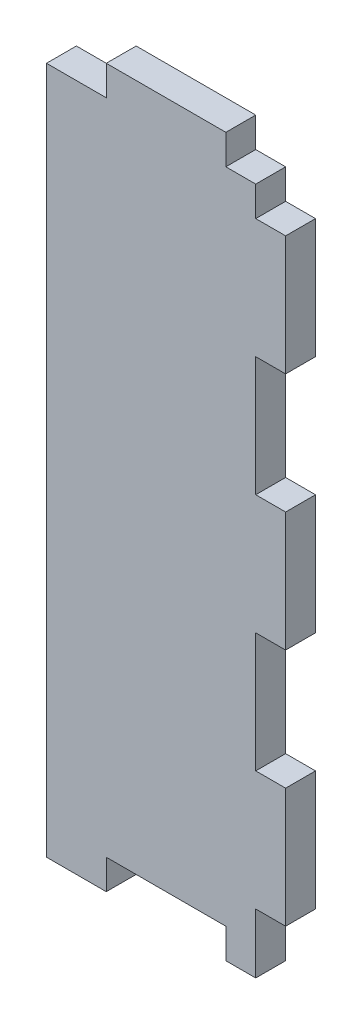
ISO-10303-21;
HEADER;
FILE_DESCRIPTION(('STEP AP214'),'2;1');
FILE_NAME('part.step','',(''),(''),'','','');
FILE_SCHEMA(('AUTOMOTIVE_DESIGN { 1 0 10303 214 1 1 1 1 }'));
ENDSEC;
DATA;
#1=APPLICATION_CONTEXT('core data for automotive mechanical design processes');
#2=APPLICATION_PROTOCOL_DEFINITION('international standard','automotive_design',2000,#1);
#3=PRODUCT_CONTEXT('',#1,'mechanical');
#4=PRODUCT('Part','Part','',(#3));
#5=PRODUCT_RELATED_PRODUCT_CATEGORY('part','',(#4));
#6=PRODUCT_DEFINITION_FORMATION('','',#4);
#7=PRODUCT_DEFINITION_CONTEXT('part definition',#1,'design');
#8=PRODUCT_DEFINITION('design','',#6,#7);
#9=PRODUCT_DEFINITION_SHAPE('','',#8);
#10=(LENGTH_UNIT() NAMED_UNIT(*) SI_UNIT(.MILLI.,.METRE.));
#11=(NAMED_UNIT(*) PLANE_ANGLE_UNIT() SI_UNIT($,.RADIAN.));
#12=(NAMED_UNIT(*) SI_UNIT($,.STERADIAN.) SOLID_ANGLE_UNIT());
#13=UNCERTAINTY_MEASURE_WITH_UNIT(LENGTH_MEASURE(1.E-05),#10,'distance_accuracy_value','');
#14=(GEOMETRIC_REPRESENTATION_CONTEXT(3) GLOBAL_UNCERTAINTY_ASSIGNED_CONTEXT((#13)) GLOBAL_UNIT_ASSIGNED_CONTEXT((#10,
#11,#12)) REPRESENTATION_CONTEXT('',''));
#15=CARTESIAN_POINT('',(0.,0.,0.));
#16=DIRECTION('',(0.,0.,1.));
#17=DIRECTION('',(1.,0.,0.));
#18=AXIS2_PLACEMENT_3D('',#15,#16,#17);
#19=CARTESIAN_POINT('',(0.,0.,3.175));
#20=DIRECTION('',(0.,1.,0.));
#21=DIRECTION('',(0.,0.,1.));
#22=AXIS2_PLACEMENT_3D('',#19,#20,#21);
#23=PLANE('',#22);
#24=DIRECTION('',(1.,0.,0.));
#25=VECTOR('',#24,1.);
#26=CARTESIAN_POINT('',(0.,0.,3.175));
#27=LINE('',#26,#25);
#28=CARTESIAN_POINT('',(19.05,0.,3.175));
#29=VERTEX_POINT('',#28);
#30=CARTESIAN_POINT('',(22.225,0.,3.175));
#31=VERTEX_POINT('',#30);
#32=EDGE_CURVE('E348',#29,#31,#27,.T.);
#33=ORIENTED_EDGE('',*,*,#32,.F.);
#34=DIRECTION('',(0.,0.,1.));
#35=VECTOR('',#34,1.);
#36=CARTESIAN_POINT('',(19.05,0.,0.));
#37=LINE('',#36,#35);
#38=CARTESIAN_POINT('',(19.05,0.,0.));
#39=VERTEX_POINT('',#38);
#40=EDGE_CURVE('E249',#39,#29,#37,.T.);
#41=ORIENTED_EDGE('',*,*,#40,.F.);
#42=DIRECTION('',(1.,0.,0.));
#43=VECTOR('',#42,1.);
#44=CARTESIAN_POINT('',(0.,0.,0.));
#45=LINE('',#44,#43);
#46=CARTESIAN_POINT('',(22.225,0.,0.));
#47=VERTEX_POINT('',#46);
#48=EDGE_CURVE('E360',#39,#47,#45,.T.);
#49=ORIENTED_EDGE('',*,*,#48,.T.);
#50=DIRECTION('',(0.,0.,1.));
#51=VECTOR('',#50,1.);
#52=CARTESIAN_POINT('',(22.225,0.,0.));
#53=LINE('',#52,#51);
#54=EDGE_CURVE('E323',#47,#31,#53,.T.);
#55=ORIENTED_EDGE('',*,*,#54,.T.);
#56=EDGE_LOOP('',(#33,#41,#49,#55));
#57=FACE_BOUND('',#56,.T.);
#58=ADVANCED_FACE('F30',(#57),#23,.F.);
#59=CARTESIAN_POINT('',(25.4,0.,3.175));
#60=DIRECTION('',(-1.,0.,0.));
#61=DIRECTION('',(0.,0.,1.));
#62=AXIS2_PLACEMENT_3D('',#59,#60,#61);
#63=PLANE('',#62);
#64=DIRECTION('',(0.,1.,0.));
#65=VECTOR('',#64,1.);
#66=CARTESIAN_POINT('',(25.4,0.,0.));
#67=LINE('',#66,#65);
#68=CARTESIAN_POINT('',(25.4,6.35000000000001,0.));
#69=VERTEX_POINT('',#68);
#70=CARTESIAN_POINT('',(25.4,19.05,0.));
#71=VERTEX_POINT('',#70);
#72=EDGE_CURVE('E365',#69,#71,#67,.T.);
#73=ORIENTED_EDGE('',*,*,#72,.T.);
#74=DIRECTION('',(0.,0.,1.));
#75=VECTOR('',#74,1.);
#76=CARTESIAN_POINT('',(25.4,19.05,0.));
#77=LINE('',#76,#75);
#78=CARTESIAN_POINT('',(25.4,19.05,3.175));
#79=VERTEX_POINT('',#78);
#80=EDGE_CURVE('E275',#71,#79,#77,.T.);
#81=ORIENTED_EDGE('',*,*,#80,.T.);
#82=DIRECTION('',(0.,1.,0.));
#83=VECTOR('',#82,1.);
#84=CARTESIAN_POINT('',(25.4,0.,3.175));
#85=LINE('',#84,#83);
#86=CARTESIAN_POINT('',(25.4,6.35000000000001,3.175));
#87=VERTEX_POINT('',#86);
#88=EDGE_CURVE('E353',#87,#79,#85,.T.);
#89=ORIENTED_EDGE('',*,*,#88,.F.);
#90=DIRECTION('',(0.,0.,1.));
#91=VECTOR('',#90,1.);
#92=CARTESIAN_POINT('',(25.4,6.35000000000001,0.));
#93=LINE('',#92,#91);
#94=EDGE_CURVE('E318',#69,#87,#93,.T.);
#95=ORIENTED_EDGE('',*,*,#94,.F.);
#96=EDGE_LOOP('',(#73,#81,#89,#95));
#97=FACE_BOUND('',#96,.T.);
#98=ADVANCED_FACE('F433',(#97),#63,.F.);
#99=CARTESIAN_POINT('',(25.4,31.75,3.175));
#100=VERTEX_POINT('',#99);
#101=CARTESIAN_POINT('',(25.4,44.45,3.175));
#102=VERTEX_POINT('',#101);
#103=EDGE_CURVE('E357',#100,#102,#85,.T.);
#104=ORIENTED_EDGE('',*,*,#103,.F.);
#105=DIRECTION('',(0.,0.,1.));
#106=VECTOR('',#105,1.);
#107=CARTESIAN_POINT('',(25.4,31.75,0.));
#108=LINE('',#107,#106);
#109=CARTESIAN_POINT('',(25.4,31.75,0.));
#110=VERTEX_POINT('',#109);
#111=EDGE_CURVE('E268',#110,#100,#108,.T.);
#112=ORIENTED_EDGE('',*,*,#111,.F.);
#113=CARTESIAN_POINT('',(25.4,44.45,0.));
#114=VERTEX_POINT('',#113);
#115=EDGE_CURVE('E368',#110,#114,#67,.T.);
#116=ORIENTED_EDGE('',*,*,#115,.T.);
#117=DIRECTION('',(0.,0.,1.));
#118=VECTOR('',#117,1.);
#119=CARTESIAN_POINT('',(25.4,44.45,0.));
#120=LINE('',#119,#118);
#121=EDGE_CURVE('E302',#114,#102,#120,.T.);
#122=ORIENTED_EDGE('',*,*,#121,.T.);
#123=EDGE_LOOP('',(#104,#112,#116,#122));
#124=FACE_BOUND('',#123,.T.);
#125=ADVANCED_FACE('F415',(#124),#63,.F.);
#126=CARTESIAN_POINT('',(0.,0.,3.175));
#127=DIRECTION('',(1.,0.,0.));
#128=DIRECTION('',(0.,0.,-1.));
#129=AXIS2_PLACEMENT_3D('',#126,#127,#128);
#130=PLANE('',#129);
#131=DIRECTION('',(0.,-1.,0.));
#132=VECTOR('',#131,1.);
#133=CARTESIAN_POINT('',(0.,0.,3.175));
#134=LINE('',#133,#132);
#135=CARTESIAN_POINT('',(0.,73.025,3.175));
#136=VERTEX_POINT('',#135);
#137=CARTESIAN_POINT('',(0.,0.,3.175));
#138=VERTEX_POINT('',#137);
#139=EDGE_CURVE('E346',#136,#138,#134,.T.);
#140=ORIENTED_EDGE('',*,*,#139,.F.);
#141=DIRECTION('',(0.,0.,1.));
#142=VECTOR('',#141,1.);
#143=CARTESIAN_POINT('',(0.,73.025,0.));
#144=LINE('',#143,#142);
#145=CARTESIAN_POINT('',(0.,73.025,0.));
#146=VERTEX_POINT('',#145);
#147=EDGE_CURVE('E220',#146,#136,#144,.T.);
#148=ORIENTED_EDGE('',*,*,#147,.F.);
#149=DIRECTION('',(0.,-1.,0.));
#150=VECTOR('',#149,1.);
#151=CARTESIAN_POINT('',(0.,0.,0.));
#152=LINE('',#151,#150);
#153=CARTESIAN_POINT('',(0.,0.,0.));
#154=VERTEX_POINT('',#153);
#155=EDGE_CURVE('E343',#146,#154,#152,.T.);
#156=ORIENTED_EDGE('',*,*,#155,.T.);
#157=DIRECTION('',(0.,0.,-1.));
#158=VECTOR('',#157,1.);
#159=CARTESIAN_POINT('',(0.,0.,3.175));
#160=LINE('',#159,#158);
#161=EDGE_CURVE('E38',#138,#154,#160,.T.);
#162=ORIENTED_EDGE('',*,*,#161,.F.);
#163=EDGE_LOOP('',(#140,#148,#156,#162));
#164=FACE_BOUND('',#163,.T.);
#165=ADVANCED_FACE('F32',(#164),#130,.F.);
#166=CARTESIAN_POINT('',(6.35,0.,0.));
#167=VERTEX_POINT('',#166);
#168=EDGE_CURVE('E361',#154,#167,#45,.T.);
#169=ORIENTED_EDGE('',*,*,#168,.T.);
#170=DIRECTION('',(0.,0.,1.));
#171=VECTOR('',#170,1.);
#172=CARTESIAN_POINT('',(6.35,0.,0.));
#173=LINE('',#172,#171);
#174=CARTESIAN_POINT('',(6.35,0.,3.175));
#175=VERTEX_POINT('',#174);
#176=EDGE_CURVE('E252',#167,#175,#173,.T.);
#177=ORIENTED_EDGE('',*,*,#176,.T.);
#178=EDGE_CURVE('E349',#138,#175,#27,.T.);
#179=ORIENTED_EDGE('',*,*,#178,.F.);
#180=ORIENTED_EDGE('',*,*,#161,.T.);
#181=EDGE_LOOP('',(#169,#177,#179,#180));
#182=FACE_BOUND('',#181,.T.);
#183=ADVANCED_FACE('F373',(#182),#23,.F.);
#184=CARTESIAN_POINT('',(25.4,57.15,3.175));
#185=VERTEX_POINT('',#184);
#186=CARTESIAN_POINT('',(25.4,69.85,3.175));
#187=VERTEX_POINT('',#186);
#188=EDGE_CURVE('E352',#185,#187,#85,.T.);
#189=ORIENTED_EDGE('',*,*,#188,.F.);
#190=DIRECTION('',(0.,0.,1.));
#191=VECTOR('',#190,1.);
#192=CARTESIAN_POINT('',(25.4,57.15,0.));
#193=LINE('',#192,#191);
#194=CARTESIAN_POINT('',(25.4,57.15,0.));
#195=VERTEX_POINT('',#194);
#196=EDGE_CURVE('E294',#195,#185,#193,.T.);
#197=ORIENTED_EDGE('',*,*,#196,.F.);
#198=CARTESIAN_POINT('',(25.4,69.85,0.));
#199=VERTEX_POINT('',#198);
#200=EDGE_CURVE('E364',#195,#199,#67,.T.);
#201=ORIENTED_EDGE('',*,*,#200,.T.);
#202=DIRECTION('',(0.,0.,1.));
#203=VECTOR('',#202,1.);
#204=CARTESIAN_POINT('',(25.4,69.85,0.));
#205=LINE('',#204,#203);
#206=EDGE_CURVE('E340',#199,#187,#205,.T.);
#207=ORIENTED_EDGE('',*,*,#206,.T.);
#208=EDGE_LOOP('',(#189,#197,#201,#207));
#209=FACE_BOUND('',#208,.T.);
#210=ADVANCED_FACE('F430',(#209),#63,.F.);
#211=CARTESIAN_POINT('',(0.,76.2,3.175));
#212=DIRECTION('',(0.,-1.,0.));
#213=DIRECTION('',(0.,0.,-1.));
#214=AXIS2_PLACEMENT_3D('',#211,#212,#213);
#215=PLANE('',#214);
#216=DIRECTION('',(-1.,0.,0.));
#217=VECTOR('',#216,1.);
#218=CARTESIAN_POINT('',(0.,76.2,3.175));
#219=LINE('',#218,#217);
#220=CARTESIAN_POINT('',(19.05,76.2,3.175));
#221=VERTEX_POINT('',#220);
#222=CARTESIAN_POINT('',(6.35,76.2,3.175));
#223=VERTEX_POINT('',#222);
#224=EDGE_CURVE('E356',#221,#223,#219,.T.);
#225=ORIENTED_EDGE('',*,*,#224,.F.);
#226=DIRECTION('',(0.,0.,1.));
#227=VECTOR('',#226,1.);
#228=CARTESIAN_POINT('',(19.05,76.2,0.));
#229=LINE('',#228,#227);
#230=CARTESIAN_POINT('',(19.05,76.2,0.));
#231=VERTEX_POINT('',#230);
#232=EDGE_CURVE('E198',#231,#221,#229,.T.);
#233=ORIENTED_EDGE('',*,*,#232,.F.);
#234=DIRECTION('',(-1.,0.,0.));
#235=VECTOR('',#234,1.);
#236=CARTESIAN_POINT('',(0.,76.2,0.));
#237=LINE('',#236,#235);
#238=CARTESIAN_POINT('',(6.35,76.2,0.));
#239=VERTEX_POINT('',#238);
#240=EDGE_CURVE('E208',#231,#239,#237,.T.);
#241=ORIENTED_EDGE('',*,*,#240,.T.);
#242=DIRECTION('',(0.,0.,1.));
#243=VECTOR('',#242,1.);
#244=CARTESIAN_POINT('',(6.35,76.2,0.));
#245=LINE('',#244,#243);
#246=EDGE_CURVE('E225',#239,#223,#245,.T.);
#247=ORIENTED_EDGE('',*,*,#246,.T.);
#248=EDGE_LOOP('',(#225,#233,#241,#247));
#249=FACE_BOUND('',#248,.T.);
#250=ADVANCED_FACE('F397',(#249),#215,.F.);
#251=CARTESIAN_POINT('',(0.,76.2,3.175));
#252=DIRECTION('',(0.,0.,-1.));
#253=DIRECTION('',(-1.,0.,0.));
#254=AXIS2_PLACEMENT_3D('',#251,#252,#253);
#255=PLANE('',#254);
#256=DIRECTION('',(1.,0.,0.));
#257=VECTOR('',#256,1.);
#258=CARTESIAN_POINT('',(19.05,73.025,3.175));
#259=LINE('',#258,#257);
#260=CARTESIAN_POINT('',(19.05,73.025,3.175));
#261=VERTEX_POINT('',#260);
#262=CARTESIAN_POINT('',(22.225,73.025,3.175));
#263=VERTEX_POINT('',#262);
#264=EDGE_CURVE('E45',#261,#263,#259,.T.);
#265=ORIENTED_EDGE('',*,*,#264,.F.);
#266=DIRECTION('',(0.,-1.,0.));
#267=VECTOR('',#266,1.);
#268=CARTESIAN_POINT('',(19.05,76.2,3.175));
#269=LINE('',#268,#267);
#270=EDGE_CURVE('E197',#221,#261,#269,.T.);
#271=ORIENTED_EDGE('',*,*,#270,.F.);
#272=ORIENTED_EDGE('',*,*,#224,.T.);
#273=DIRECTION('',(0.,1.,0.));
#274=VECTOR('',#273,1.);
#275=CARTESIAN_POINT('',(6.35,76.2,3.175));
#276=LINE('',#275,#274);
#277=CARTESIAN_POINT('',(6.35,73.025,3.175));
#278=VERTEX_POINT('',#277);
#279=EDGE_CURVE('E218',#278,#223,#276,.T.);
#280=ORIENTED_EDGE('',*,*,#279,.F.);
#281=DIRECTION('',(1.,0.,0.));
#282=VECTOR('',#281,1.);
#283=CARTESIAN_POINT('',(0.,73.025,3.175));
#284=LINE('',#283,#282);
#285=EDGE_CURVE('E213',#136,#278,#284,.T.);
#286=ORIENTED_EDGE('',*,*,#285,.F.);
#287=ORIENTED_EDGE('',*,*,#139,.T.);
#288=ORIENTED_EDGE('',*,*,#178,.T.);
#289=DIRECTION('',(0.,-1.,0.));
#290=VECTOR('',#289,1.);
#291=CARTESIAN_POINT('',(6.35,0.,3.175));
#292=LINE('',#291,#290);
#293=CARTESIAN_POINT('',(6.35,3.175,3.175));
#294=VERTEX_POINT('',#293);
#295=EDGE_CURVE('E236',#294,#175,#292,.T.);
#296=ORIENTED_EDGE('',*,*,#295,.F.);
#297=DIRECTION('',(-1.,0.,0.));
#298=VECTOR('',#297,1.);
#299=CARTESIAN_POINT('',(19.05,3.175,3.175));
#300=LINE('',#299,#298);
#301=CARTESIAN_POINT('',(19.05,3.175,3.175));
#302=VERTEX_POINT('',#301);
#303=EDGE_CURVE('E245',#302,#294,#300,.T.);
#304=ORIENTED_EDGE('',*,*,#303,.F.);
#305=DIRECTION('',(0.,1.,0.));
#306=VECTOR('',#305,1.);
#307=CARTESIAN_POINT('',(19.05,0.,3.175));
#308=LINE('',#307,#306);
#309=EDGE_CURVE('E228',#29,#302,#308,.T.);
#310=ORIENTED_EDGE('',*,*,#309,.F.);
#311=ORIENTED_EDGE('',*,*,#32,.T.);
#312=DIRECTION('',(0.,-1.,0.));
#313=VECTOR('',#312,1.);
#314=CARTESIAN_POINT('',(22.225,0.,3.175));
#315=LINE('',#314,#313);
#316=CARTESIAN_POINT('',(22.225,6.35000000000001,3.175));
#317=VERTEX_POINT('',#316);
#318=EDGE_CURVE('E315',#317,#31,#315,.T.);
#319=ORIENTED_EDGE('',*,*,#318,.F.);
#320=DIRECTION('',(-1.,0.,0.));
#321=VECTOR('',#320,1.);
#322=CARTESIAN_POINT('',(25.4,6.35000000000001,3.175));
#323=LINE('',#322,#321);
#324=EDGE_CURVE('E305',#87,#317,#323,.T.);
#325=ORIENTED_EDGE('',*,*,#324,.F.);
#326=ORIENTED_EDGE('',*,*,#88,.T.);
#327=DIRECTION('',(1.,0.,0.));
#328=VECTOR('',#327,1.);
#329=CARTESIAN_POINT('',(25.4,19.05,3.175));
#330=LINE('',#329,#328);
#331=CARTESIAN_POINT('',(22.225,19.05,3.175));
#332=VERTEX_POINT('',#331);
#333=EDGE_CURVE('E262',#332,#79,#330,.T.);
#334=ORIENTED_EDGE('',*,*,#333,.F.);
#335=DIRECTION('',(0.,-1.,0.));
#336=VECTOR('',#335,1.);
#337=CARTESIAN_POINT('',(22.225,31.75,3.175));
#338=LINE('',#337,#336);
#339=CARTESIAN_POINT('',(22.225,31.75,3.175));
#340=VERTEX_POINT('',#339);
#341=EDGE_CURVE('E271',#340,#332,#338,.T.);
#342=ORIENTED_EDGE('',*,*,#341,.F.);
#343=DIRECTION('',(-1.,0.,0.));
#344=VECTOR('',#343,1.);
#345=CARTESIAN_POINT('',(25.4,31.75,3.175));
#346=LINE('',#345,#344);
#347=EDGE_CURVE('E251',#100,#340,#346,.T.);
#348=ORIENTED_EDGE('',*,*,#347,.F.);
#349=ORIENTED_EDGE('',*,*,#103,.T.);
#350=DIRECTION('',(1.,0.,0.));
#351=VECTOR('',#350,1.);
#352=CARTESIAN_POINT('',(25.4,44.45,3.175));
#353=LINE('',#352,#351);
#354=CARTESIAN_POINT('',(22.225,44.45,3.175));
#355=VERTEX_POINT('',#354);
#356=EDGE_CURVE('E288',#355,#102,#353,.T.);
#357=ORIENTED_EDGE('',*,*,#356,.F.);
#358=DIRECTION('',(0.,-1.,0.));
#359=VECTOR('',#358,1.);
#360=CARTESIAN_POINT('',(22.225,57.15,3.175));
#361=LINE('',#360,#359);
#362=CARTESIAN_POINT('',(22.225,57.15,3.175));
#363=VERTEX_POINT('',#362);
#364=EDGE_CURVE('E297',#363,#355,#361,.T.);
#365=ORIENTED_EDGE('',*,*,#364,.F.);
#366=DIRECTION('',(-1.,0.,0.));
#367=VECTOR('',#366,1.);
#368=CARTESIAN_POINT('',(25.4,57.15,3.175));
#369=LINE('',#368,#367);
#370=EDGE_CURVE('E278',#185,#363,#369,.T.);
#371=ORIENTED_EDGE('',*,*,#370,.F.);
#372=ORIENTED_EDGE('',*,*,#188,.T.);
#373=DIRECTION('',(1.,0.,0.));
#374=VECTOR('',#373,1.);
#375=CARTESIAN_POINT('',(25.4,69.85,3.175));
#376=LINE('',#375,#374);
#377=CARTESIAN_POINT('',(22.225,69.85,3.175));
#378=VERTEX_POINT('',#377);
#379=EDGE_CURVE('E333',#378,#187,#376,.T.);
#380=ORIENTED_EDGE('',*,*,#379,.F.);
#381=DIRECTION('',(0.,-1.,0.));
#382=VECTOR('',#381,1.);
#383=CARTESIAN_POINT('',(22.225,69.85,3.175));
#384=LINE('',#383,#382);
#385=EDGE_CURVE('E326',#263,#378,#384,.T.);
#386=ORIENTED_EDGE('',*,*,#385,.F.);
#387=EDGE_LOOP('',(#265,#271,#272,#280,#286,#287,#288,#296,#304,#310,#311,#319,#325,#326,#334,
#342,#348,#349,#357,#365,#371,#372,#380,#386));
#388=FACE_BOUND('',#387,.T.);
#389=ADVANCED_FACE('F389',(#388),#255,.F.);
#390=CARTESIAN_POINT('',(0.,76.2,0.));
#391=DIRECTION('',(0.,0.,-1.));
#392=DIRECTION('',(-1.,0.,0.));
#393=AXIS2_PLACEMENT_3D('',#390,#391,#392);
#394=PLANE('',#393);
#395=DIRECTION('',(0.,-1.,0.));
#396=VECTOR('',#395,1.);
#397=CARTESIAN_POINT('',(19.05,76.2,0.));
#398=LINE('',#397,#396);
#399=CARTESIAN_POINT('',(19.05,73.025,0.));
#400=VERTEX_POINT('',#399);
#401=EDGE_CURVE('E194',#231,#400,#398,.T.);
#402=ORIENTED_EDGE('',*,*,#401,.T.);
#403=DIRECTION('',(1.,0.,0.));
#404=VECTOR('',#403,1.);
#405=CARTESIAN_POINT('',(19.05,73.025,0.));
#406=LINE('',#405,#404);
#407=CARTESIAN_POINT('',(22.225,73.025,0.));
#408=VERTEX_POINT('',#407);
#409=EDGE_CURVE('E199',#400,#408,#406,.T.);
#410=ORIENTED_EDGE('',*,*,#409,.T.);
#411=DIRECTION('',(0.,-1.,0.));
#412=VECTOR('',#411,1.);
#413=CARTESIAN_POINT('',(22.225,69.85,0.));
#414=LINE('',#413,#412);
#415=CARTESIAN_POINT('',(22.225,69.85,0.));
#416=VERTEX_POINT('',#415);
#417=EDGE_CURVE('E330',#408,#416,#414,.T.);
#418=ORIENTED_EDGE('',*,*,#417,.T.);
#419=DIRECTION('',(1.,0.,0.));
#420=VECTOR('',#419,1.);
#421=CARTESIAN_POINT('',(25.4,69.85,0.));
#422=LINE('',#421,#420);
#423=EDGE_CURVE('E332',#416,#199,#422,.T.);
#424=ORIENTED_EDGE('',*,*,#423,.T.);
#425=ORIENTED_EDGE('',*,*,#200,.F.);
#426=DIRECTION('',(-1.,0.,0.));
#427=VECTOR('',#426,1.);
#428=CARTESIAN_POINT('',(25.4,57.15,0.));
#429=LINE('',#428,#427);
#430=CARTESIAN_POINT('',(22.225,57.15,0.));
#431=VERTEX_POINT('',#430);
#432=EDGE_CURVE('E284',#195,#431,#429,.T.);
#433=ORIENTED_EDGE('',*,*,#432,.T.);
#434=DIRECTION('',(0.,-1.,0.));
#435=VECTOR('',#434,1.);
#436=CARTESIAN_POINT('',(22.225,57.15,0.));
#437=LINE('',#436,#435);
#438=CARTESIAN_POINT('',(22.225,44.45,0.));
#439=VERTEX_POINT('',#438);
#440=EDGE_CURVE('E287',#431,#439,#437,.T.);
#441=ORIENTED_EDGE('',*,*,#440,.T.);
#442=DIRECTION('',(1.,0.,0.));
#443=VECTOR('',#442,1.);
#444=CARTESIAN_POINT('',(25.4,44.45,0.));
#445=LINE('',#444,#443);
#446=EDGE_CURVE('E291',#439,#114,#445,.T.);
#447=ORIENTED_EDGE('',*,*,#446,.T.);
#448=ORIENTED_EDGE('',*,*,#115,.F.);
#449=DIRECTION('',(-1.,0.,0.));
#450=VECTOR('',#449,1.);
#451=CARTESIAN_POINT('',(25.4,31.75,0.));
#452=LINE('',#451,#450);
#453=CARTESIAN_POINT('',(22.225,31.75,0.));
#454=VERTEX_POINT('',#453);
#455=EDGE_CURVE('E258',#110,#454,#452,.T.);
#456=ORIENTED_EDGE('',*,*,#455,.T.);
#457=DIRECTION('',(0.,-1.,0.));
#458=VECTOR('',#457,1.);
#459=CARTESIAN_POINT('',(22.225,31.75,0.));
#460=LINE('',#459,#458);
#461=CARTESIAN_POINT('',(22.225,19.05,0.));
#462=VERTEX_POINT('',#461);
#463=EDGE_CURVE('E261',#454,#462,#460,.T.);
#464=ORIENTED_EDGE('',*,*,#463,.T.);
#465=DIRECTION('',(1.,0.,0.));
#466=VECTOR('',#465,1.);
#467=CARTESIAN_POINT('',(25.4,19.05,0.));
#468=LINE('',#467,#466);
#469=EDGE_CURVE('E265',#462,#71,#468,.T.);
#470=ORIENTED_EDGE('',*,*,#469,.T.);
#471=ORIENTED_EDGE('',*,*,#72,.F.);
#472=DIRECTION('',(-1.,0.,0.));
#473=VECTOR('',#472,1.);
#474=CARTESIAN_POINT('',(25.4,6.35000000000001,0.));
#475=LINE('',#474,#473);
#476=CARTESIAN_POINT('',(22.225,6.35000000000001,0.));
#477=VERTEX_POINT('',#476);
#478=EDGE_CURVE('E311',#69,#477,#475,.T.);
#479=ORIENTED_EDGE('',*,*,#478,.T.);
#480=DIRECTION('',(0.,-1.,0.));
#481=VECTOR('',#480,1.);
#482=CARTESIAN_POINT('',(22.225,0.,0.));
#483=LINE('',#482,#481);
#484=EDGE_CURVE('E314',#477,#47,#483,.T.);
#485=ORIENTED_EDGE('',*,*,#484,.T.);
#486=ORIENTED_EDGE('',*,*,#48,.F.);
#487=DIRECTION('',(0.,1.,0.));
#488=VECTOR('',#487,1.);
#489=CARTESIAN_POINT('',(19.05,0.,0.));
#490=LINE('',#489,#488);
#491=CARTESIAN_POINT('',(19.05,3.175,0.));
#492=VERTEX_POINT('',#491);
#493=EDGE_CURVE('E232',#39,#492,#490,.T.);
#494=ORIENTED_EDGE('',*,*,#493,.T.);
#495=DIRECTION('',(-1.,0.,0.));
#496=VECTOR('',#495,1.);
#497=CARTESIAN_POINT('',(19.05,3.175,0.));
#498=LINE('',#497,#496);
#499=CARTESIAN_POINT('',(6.35,3.175,0.));
#500=VERTEX_POINT('',#499);
#501=EDGE_CURVE('E235',#492,#500,#498,.T.);
#502=ORIENTED_EDGE('',*,*,#501,.T.);
#503=DIRECTION('',(0.,-1.,0.));
#504=VECTOR('',#503,1.);
#505=CARTESIAN_POINT('',(6.35,0.,0.));
#506=LINE('',#505,#504);
#507=EDGE_CURVE('E239',#500,#167,#506,.T.);
#508=ORIENTED_EDGE('',*,*,#507,.T.);
#509=ORIENTED_EDGE('',*,*,#168,.F.);
#510=ORIENTED_EDGE('',*,*,#155,.F.);
#511=DIRECTION('',(1.,0.,0.));
#512=VECTOR('',#511,1.);
#513=CARTESIAN_POINT('',(0.,73.025,0.));
#514=LINE('',#513,#512);
#515=CARTESIAN_POINT('',(6.35,73.025,0.));
#516=VERTEX_POINT('',#515);
#517=EDGE_CURVE('E215',#146,#516,#514,.T.);
#518=ORIENTED_EDGE('',*,*,#517,.T.);
#519=DIRECTION('',(0.,1.,0.));
#520=VECTOR('',#519,1.);
#521=CARTESIAN_POINT('',(6.35,76.2,0.));
#522=LINE('',#521,#520);
#523=EDGE_CURVE('E52',#516,#239,#522,.T.);
#524=ORIENTED_EDGE('',*,*,#523,.T.);
#525=ORIENTED_EDGE('',*,*,#240,.F.);
#526=EDGE_LOOP('',(#402,#410,#418,#424,#425,#433,#441,#447,#448,#456,#464,#470,#471,#479,#485,
#486,#494,#502,#508,#509,#510,#518,#524,#525));
#527=FACE_BOUND('',#526,.T.);
#528=ADVANCED_FACE('F207',(#527),#394,.T.);
#529=CARTESIAN_POINT('',(25.4,69.85,0.));
#530=DIRECTION('',(0.,-1.,0.));
#531=DIRECTION('',(0.,0.,-1.));
#532=AXIS2_PLACEMENT_3D('',#529,#530,#531);
#533=PLANE('',#532);
#534=ORIENTED_EDGE('',*,*,#379,.T.);
#535=ORIENTED_EDGE('',*,*,#206,.F.);
#536=ORIENTED_EDGE('',*,*,#423,.F.);
#537=DIRECTION('',(0.,0.,1.));
#538=VECTOR('',#537,1.);
#539=CARTESIAN_POINT('',(22.225,69.85,0.));
#540=LINE('',#539,#538);
#541=EDGE_CURVE('E336',#416,#378,#540,.T.);
#542=ORIENTED_EDGE('',*,*,#541,.T.);
#543=EDGE_LOOP('',(#534,#535,#536,#542));
#544=FACE_BOUND('',#543,.T.);
#545=ADVANCED_FACE('F405',(#544),#533,.F.);
#546=CARTESIAN_POINT('',(22.225,69.85,0.));
#547=DIRECTION('',(-1.,0.,0.));
#548=DIRECTION('',(0.,0.,1.));
#549=AXIS2_PLACEMENT_3D('',#546,#547,#548);
#550=PLANE('',#549);
#551=ORIENTED_EDGE('',*,*,#417,.F.);
#552=DIRECTION('',(0.,0.,1.));
#553=VECTOR('',#552,1.);
#554=CARTESIAN_POINT('',(22.225,73.025,0.));
#555=LINE('',#554,#553);
#556=EDGE_CURVE('E11',#408,#263,#555,.T.);
#557=ORIENTED_EDGE('',*,*,#556,.T.);
#558=ORIENTED_EDGE('',*,*,#385,.T.);
#559=ORIENTED_EDGE('',*,*,#541,.F.);
#560=EDGE_LOOP('',(#551,#557,#558,#559));
#561=FACE_BOUND('',#560,.T.);
#562=ADVANCED_FACE('F402',(#561),#550,.F.);
#563=CARTESIAN_POINT('',(22.225,0.,0.));
#564=DIRECTION('',(-1.,0.,0.));
#565=DIRECTION('',(0.,0.,1.));
#566=AXIS2_PLACEMENT_3D('',#563,#564,#565);
#567=PLANE('',#566);
#568=ORIENTED_EDGE('',*,*,#318,.T.);
#569=ORIENTED_EDGE('',*,*,#54,.F.);
#570=ORIENTED_EDGE('',*,*,#484,.F.);
#571=DIRECTION('',(0.,0.,1.));
#572=VECTOR('',#571,1.);
#573=CARTESIAN_POINT('',(22.225,6.35000000000001,0.));
#574=LINE('',#573,#572);
#575=EDGE_CURVE('E327',#477,#317,#574,.T.);
#576=ORIENTED_EDGE('',*,*,#575,.T.);
#577=EDGE_LOOP('',(#568,#569,#570,#576));
#578=FACE_BOUND('',#577,.T.);
#579=ADVANCED_FACE('F453',(#578),#567,.F.);
#580=CARTESIAN_POINT('',(25.4,6.35000000000001,0.));
#581=DIRECTION('',(0.,1.,0.));
#582=DIRECTION('',(0.,0.,1.));
#583=AXIS2_PLACEMENT_3D('',#580,#581,#582);
#584=PLANE('',#583);
#585=ORIENTED_EDGE('',*,*,#324,.T.);
#586=ORIENTED_EDGE('',*,*,#575,.F.);
#587=ORIENTED_EDGE('',*,*,#478,.F.);
#588=ORIENTED_EDGE('',*,*,#94,.T.);
#589=EDGE_LOOP('',(#585,#586,#587,#588));
#590=FACE_BOUND('',#589,.T.);
#591=ADVANCED_FACE('F456',(#590),#584,.F.);
#592=CARTESIAN_POINT('',(25.4,44.45,0.));
#593=DIRECTION('',(0.,-1.,0.));
#594=DIRECTION('',(0.,0.,-1.));
#595=AXIS2_PLACEMENT_3D('',#592,#593,#594);
#596=PLANE('',#595);
#597=ORIENTED_EDGE('',*,*,#356,.T.);
#598=ORIENTED_EDGE('',*,*,#121,.F.);
#599=ORIENTED_EDGE('',*,*,#446,.F.);
#600=DIRECTION('',(0.,0.,1.));
#601=VECTOR('',#600,1.);
#602=CARTESIAN_POINT('',(22.225,44.45,0.));
#603=LINE('',#602,#601);
#604=EDGE_CURVE('E306',#439,#355,#603,.T.);
#605=ORIENTED_EDGE('',*,*,#604,.T.);
#606=EDGE_LOOP('',(#597,#598,#599,#605));
#607=FACE_BOUND('',#606,.T.);
#608=ADVANCED_FACE('F418',(#607),#596,.F.);
#609=CARTESIAN_POINT('',(22.225,57.15,0.));
#610=DIRECTION('',(-1.,0.,0.));
#611=DIRECTION('',(0.,0.,1.));
#612=AXIS2_PLACEMENT_3D('',#609,#610,#611);
#613=PLANE('',#612);
#614=ORIENTED_EDGE('',*,*,#364,.T.);
#615=ORIENTED_EDGE('',*,*,#604,.F.);
#616=ORIENTED_EDGE('',*,*,#440,.F.);
#617=DIRECTION('',(0.,0.,1.));
#618=VECTOR('',#617,1.);
#619=CARTESIAN_POINT('',(22.225,57.15,0.));
#620=LINE('',#619,#618);
#621=EDGE_CURVE('E308',#431,#363,#620,.T.);
#622=ORIENTED_EDGE('',*,*,#621,.T.);
#623=EDGE_LOOP('',(#614,#615,#616,#622));
#624=FACE_BOUND('',#623,.T.);
#625=ADVANCED_FACE('F422',(#624),#613,.F.);
#626=CARTESIAN_POINT('',(25.4,57.15,0.));
#627=DIRECTION('',(0.,1.,0.));
#628=DIRECTION('',(0.,0.,1.));
#629=AXIS2_PLACEMENT_3D('',#626,#627,#628);
#630=PLANE('',#629);
#631=ORIENTED_EDGE('',*,*,#370,.T.);
#632=ORIENTED_EDGE('',*,*,#621,.F.);
#633=ORIENTED_EDGE('',*,*,#432,.F.);
#634=ORIENTED_EDGE('',*,*,#196,.T.);
#635=EDGE_LOOP('',(#631,#632,#633,#634));
#636=FACE_BOUND('',#635,.T.);
#637=ADVANCED_FACE('F424',(#636),#630,.F.);
#638=CARTESIAN_POINT('',(25.4,19.05,0.));
#639=DIRECTION('',(0.,-1.,0.));
#640=DIRECTION('',(0.,0.,-1.));
#641=AXIS2_PLACEMENT_3D('',#638,#639,#640);
#642=PLANE('',#641);
#643=ORIENTED_EDGE('',*,*,#333,.T.);
#644=ORIENTED_EDGE('',*,*,#80,.F.);
#645=ORIENTED_EDGE('',*,*,#469,.F.);
#646=DIRECTION('',(0.,0.,1.));
#647=VECTOR('',#646,1.);
#648=CARTESIAN_POINT('',(22.225,19.05,0.));
#649=LINE('',#648,#647);
#650=EDGE_CURVE('E279',#462,#332,#649,.T.);
#651=ORIENTED_EDGE('',*,*,#650,.T.);
#652=EDGE_LOOP('',(#643,#644,#645,#651));
#653=FACE_BOUND('',#652,.T.);
#654=ADVANCED_FACE('F463',(#653),#642,.F.);
#655=CARTESIAN_POINT('',(22.225,31.75,0.));
#656=DIRECTION('',(-1.,0.,0.));
#657=DIRECTION('',(0.,0.,1.));
#658=AXIS2_PLACEMENT_3D('',#655,#656,#657);
#659=PLANE('',#658);
#660=ORIENTED_EDGE('',*,*,#341,.T.);
#661=ORIENTED_EDGE('',*,*,#650,.F.);
#662=ORIENTED_EDGE('',*,*,#463,.F.);
#663=DIRECTION('',(0.,0.,1.));
#664=VECTOR('',#663,1.);
#665=CARTESIAN_POINT('',(22.225,31.75,0.));
#666=LINE('',#665,#664);
#667=EDGE_CURVE('E281',#454,#340,#666,.T.);
#668=ORIENTED_EDGE('',*,*,#667,.T.);
#669=EDGE_LOOP('',(#660,#661,#662,#668));
#670=FACE_BOUND('',#669,.T.);
#671=ADVANCED_FACE('F466',(#670),#659,.F.);
#672=CARTESIAN_POINT('',(25.4,31.75,0.));
#673=DIRECTION('',(0.,1.,0.));
#674=DIRECTION('',(0.,0.,1.));
#675=AXIS2_PLACEMENT_3D('',#672,#673,#674);
#676=PLANE('',#675);
#677=ORIENTED_EDGE('',*,*,#347,.T.);
#678=ORIENTED_EDGE('',*,*,#667,.F.);
#679=ORIENTED_EDGE('',*,*,#455,.F.);
#680=ORIENTED_EDGE('',*,*,#111,.T.);
#681=EDGE_LOOP('',(#677,#678,#679,#680));
#682=FACE_BOUND('',#681,.T.);
#683=ADVANCED_FACE('F468',(#682),#676,.F.);
#684=CARTESIAN_POINT('',(19.05,0.,0.));
#685=DIRECTION('',(1.,0.,0.));
#686=DIRECTION('',(0.,0.,-1.));
#687=AXIS2_PLACEMENT_3D('',#684,#685,#686);
#688=PLANE('',#687);
#689=ORIENTED_EDGE('',*,*,#309,.T.);
#690=DIRECTION('',(0.,0.,1.));
#691=VECTOR('',#690,1.);
#692=CARTESIAN_POINT('',(19.05,3.175,0.));
#693=LINE('',#692,#691);
#694=EDGE_CURVE('E242',#492,#302,#693,.T.);
#695=ORIENTED_EDGE('',*,*,#694,.F.);
#696=ORIENTED_EDGE('',*,*,#493,.F.);
#697=ORIENTED_EDGE('',*,*,#40,.T.);
#698=EDGE_LOOP('',(#689,#695,#696,#697));
#699=FACE_BOUND('',#698,.T.);
#700=ADVANCED_FACE('F470',(#699),#688,.F.);
#701=CARTESIAN_POINT('',(6.35,0.,0.));
#702=DIRECTION('',(-1.,0.,0.));
#703=DIRECTION('',(0.,0.,1.));
#704=AXIS2_PLACEMENT_3D('',#701,#702,#703);
#705=PLANE('',#704);
#706=ORIENTED_EDGE('',*,*,#295,.T.);
#707=ORIENTED_EDGE('',*,*,#176,.F.);
#708=ORIENTED_EDGE('',*,*,#507,.F.);
#709=DIRECTION('',(0.,0.,1.));
#710=VECTOR('',#709,1.);
#711=CARTESIAN_POINT('',(6.35,3.175,0.));
#712=LINE('',#711,#710);
#713=EDGE_CURVE('E255',#500,#294,#712,.T.);
#714=ORIENTED_EDGE('',*,*,#713,.T.);
#715=EDGE_LOOP('',(#706,#707,#708,#714));
#716=FACE_BOUND('',#715,.T.);
#717=ADVANCED_FACE('F382',(#716),#705,.F.);
#718=CARTESIAN_POINT('',(19.05,3.175,0.));
#719=DIRECTION('',(0.,1.,0.));
#720=DIRECTION('',(-1.,0.,0.));
#721=AXIS2_PLACEMENT_3D('',#718,#719,#720);
#722=PLANE('',#721);
#723=ORIENTED_EDGE('',*,*,#303,.T.);
#724=ORIENTED_EDGE('',*,*,#713,.F.);
#725=ORIENTED_EDGE('',*,*,#501,.F.);
#726=ORIENTED_EDGE('',*,*,#694,.T.);
#727=EDGE_LOOP('',(#723,#724,#725,#726));
#728=FACE_BOUND('',#727,.T.);
#729=ADVANCED_FACE('F384',(#728),#722,.F.);
#730=CARTESIAN_POINT('',(6.35,76.2,0.));
#731=DIRECTION('',(1.,0.,0.));
#732=DIRECTION('',(0.,1.,0.));
#733=AXIS2_PLACEMENT_3D('',#730,#731,#732);
#734=PLANE('',#733);
#735=ORIENTED_EDGE('',*,*,#279,.T.);
#736=ORIENTED_EDGE('',*,*,#246,.F.);
#737=ORIENTED_EDGE('',*,*,#523,.F.);
#738=DIRECTION('',(0.,0.,1.));
#739=VECTOR('',#738,1.);
#740=CARTESIAN_POINT('',(6.35,73.025,0.));
#741=LINE('',#740,#739);
#742=EDGE_CURVE('E229',#516,#278,#741,.T.);
#743=ORIENTED_EDGE('',*,*,#742,.T.);
#744=EDGE_LOOP('',(#735,#736,#737,#743));
#745=FACE_BOUND('',#744,.T.);
#746=ADVANCED_FACE('F394',(#745),#734,.F.);
#747=CARTESIAN_POINT('',(0.,73.025,0.));
#748=DIRECTION('',(0.,-1.,0.));
#749=DIRECTION('',(0.,0.,-1.));
#750=AXIS2_PLACEMENT_3D('',#747,#748,#749);
#751=PLANE('',#750);
#752=ORIENTED_EDGE('',*,*,#285,.T.);
#753=ORIENTED_EDGE('',*,*,#742,.F.);
#754=ORIENTED_EDGE('',*,*,#517,.F.);
#755=ORIENTED_EDGE('',*,*,#147,.T.);
#756=EDGE_LOOP('',(#752,#753,#754,#755));
#757=FACE_BOUND('',#756,.T.);
#758=ADVANCED_FACE('F393',(#757),#751,.F.);
#759=CARTESIAN_POINT('',(19.05,73.025,0.));
#760=DIRECTION('',(0.,-1.,0.));
#761=DIRECTION('',(0.,0.,-1.));
#762=AXIS2_PLACEMENT_3D('',#759,#760,#761);
#763=PLANE('',#762);
#764=ORIENTED_EDGE('',*,*,#409,.F.);
#765=DIRECTION('',(0.,0.,1.));
#766=VECTOR('',#765,1.);
#767=CARTESIAN_POINT('',(19.05,73.025,0.));
#768=LINE('',#767,#766);
#769=EDGE_CURVE('E190',#400,#261,#768,.T.);
#770=ORIENTED_EDGE('',*,*,#769,.T.);
#771=ORIENTED_EDGE('',*,*,#264,.T.);
#772=ORIENTED_EDGE('',*,*,#556,.F.);
#773=EDGE_LOOP('',(#764,#770,#771,#772));
#774=FACE_BOUND('',#773,.T.);
#775=ADVANCED_FACE('F202',(#774),#763,.F.);
#776=CARTESIAN_POINT('',(19.05,76.2,0.));
#777=DIRECTION('',(-1.,0.,0.));
#778=DIRECTION('',(0.,-1.,0.));
#779=AXIS2_PLACEMENT_3D('',#776,#777,#778);
#780=PLANE('',#779);
#781=ORIENTED_EDGE('',*,*,#270,.T.);
#782=ORIENTED_EDGE('',*,*,#769,.F.);
#783=ORIENTED_EDGE('',*,*,#401,.F.);
#784=ORIENTED_EDGE('',*,*,#232,.T.);
#785=EDGE_LOOP('',(#781,#782,#783,#784));
#786=FACE_BOUND('',#785,.T.);
#787=ADVANCED_FACE('F192',(#786),#780,.F.);
#788=CLOSED_SHELL('',(#58,#98,#125,#165,#183,#210,#250,#389,#528,#545,#562,#579,#591,#608,#625,
#637,#654,#671,#683,#700,#717,#729,#746,#758,#775,#787));
#789=MANIFOLD_SOLID_BREP('B2',#788);
#790=ADVANCED_BREP_SHAPE_REPRESENTATION('',(#18,#789),#14);
#791=SHAPE_DEFINITION_REPRESENTATION(#9,#790);
ENDSEC;
END-ISO-10303-21;
